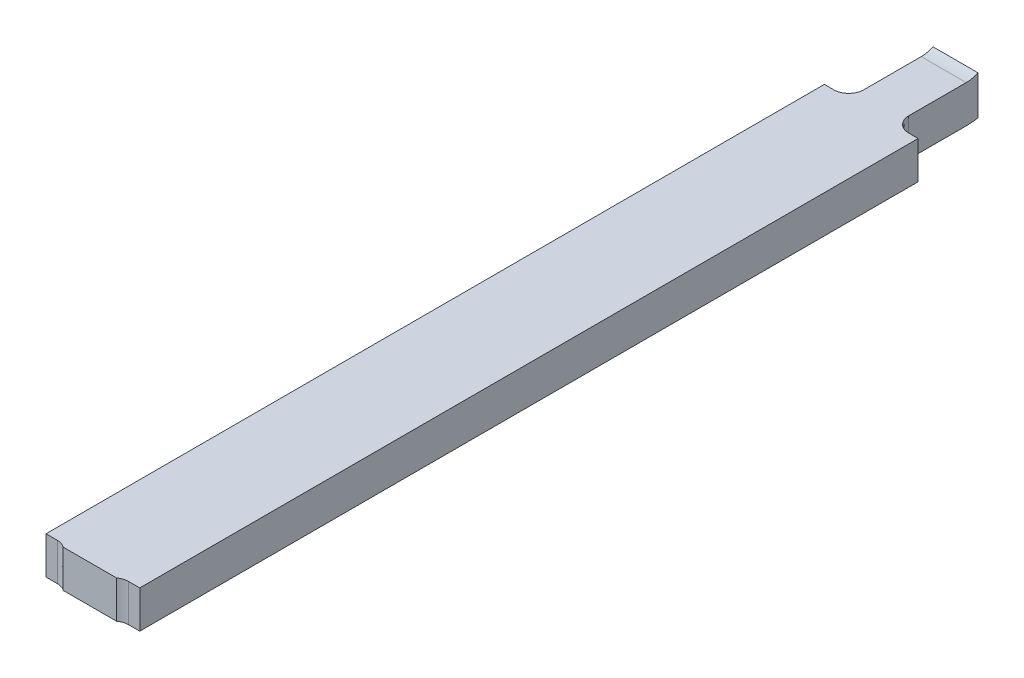
ISO-10303-21;
HEADER;
FILE_DESCRIPTION(('STEP AP214'),'2;1');
FILE_NAME('part.step','',(''),(''),'','','');
FILE_SCHEMA(('AUTOMOTIVE_DESIGN { 1 0 10303 214 1 1 1 1 }'));
ENDSEC;
DATA;
#1=APPLICATION_CONTEXT('core data for automotive mechanical design processes');
#2=APPLICATION_PROTOCOL_DEFINITION('international standard','automotive_design',2000,#1);
#3=PRODUCT_CONTEXT('',#1,'mechanical');
#4=PRODUCT('Part','Part','',(#3));
#5=PRODUCT_RELATED_PRODUCT_CATEGORY('part','',(#4));
#6=PRODUCT_DEFINITION_FORMATION('','',#4);
#7=PRODUCT_DEFINITION_CONTEXT('part definition',#1,'design');
#8=PRODUCT_DEFINITION('design','',#6,#7);
#9=PRODUCT_DEFINITION_SHAPE('','',#8);
#10=(LENGTH_UNIT() NAMED_UNIT(*) SI_UNIT(.MILLI.,.METRE.));
#11=(NAMED_UNIT(*) PLANE_ANGLE_UNIT() SI_UNIT($,.RADIAN.));
#12=(NAMED_UNIT(*) SI_UNIT($,.STERADIAN.) SOLID_ANGLE_UNIT());
#13=UNCERTAINTY_MEASURE_WITH_UNIT(LENGTH_MEASURE(1.E-05),#10,'distance_accuracy_value','');
#14=(GEOMETRIC_REPRESENTATION_CONTEXT(3) GLOBAL_UNCERTAINTY_ASSIGNED_CONTEXT((#13)) GLOBAL_UNIT_ASSIGNED_CONTEXT((#10,
#11,#12)) REPRESENTATION_CONTEXT('',''));
#15=CARTESIAN_POINT('',(0.,0.,0.));
#16=DIRECTION('',(0.,0.,1.));
#17=DIRECTION('',(1.,0.,0.));
#18=AXIS2_PLACEMENT_3D('',#15,#16,#17);
#19=CARTESIAN_POINT('',(1.,-0.3652289464185,-7.500488855463));
#20=DIRECTION('',(0.,0.,1.));
#21=DIRECTION('',(1.,0.,0.));
#22=AXIS2_PLACEMENT_3D('',#19,#20,#21);
#23=PLANE('',#22);
#24=DIRECTION('',(0.,1.,0.));
#25=VECTOR('',#24,1.);
#26=CARTESIAN_POINT('',(1.12,-0.3694122088881,-7.500488855463));
#27=LINE('',#26,#25);
#28=CARTESIAN_POINT('',(1.12,-0.469296338681694,-7.50048885546298));
#29=VERTEX_POINT('',#28);
#30=CARTESIAN_POINT('',(1.12,-0.261161554155171,-7.50048885546301));
#31=VERTEX_POINT('',#30);
#32=EDGE_CURVE('E150',#29,#31,#27,.T.);
#33=ORIENTED_EDGE('',*,*,#32,.F.);
#34=DIRECTION('',(-1.,0.,0.));
#35=VECTOR('',#34,1.);
#36=CARTESIAN_POINT('',(1.125727283719,-0.469296338681697,-7.50048885546296));
#37=LINE('',#36,#35);
#38=CARTESIAN_POINT('',(0.88,-0.469296338681694,-7.50048885546298));
#39=VERTEX_POINT('',#38);
#40=EDGE_CURVE('E139',#39,#29,#37,.F.);
#41=ORIENTED_EDGE('',*,*,#40,.F.);
#42=DIRECTION('',(0.,1.,0.));
#43=VECTOR('',#42,1.);
#44=CARTESIAN_POINT('',(0.88,-0.3694122088881,-7.500488855463));
#45=LINE('',#44,#43);
#46=CARTESIAN_POINT('',(0.88,-0.261161554155171,-7.50048885546301));
#47=VERTEX_POINT('',#46);
#48=EDGE_CURVE('E535',#39,#47,#45,.T.);
#49=ORIENTED_EDGE('',*,*,#48,.T.);
#50=DIRECTION('',(1.,0.,0.));
#51=VECTOR('',#50,1.);
#52=CARTESIAN_POINT('',(0.874272716281,-0.261161554155164,-7.50048885546303));
#53=LINE('',#52,#51);
#54=EDGE_CURVE('E147',#47,#31,#53,.T.);
#55=ORIENTED_EDGE('',*,*,#54,.T.);
#56=EDGE_LOOP('',(#33,#41,#49,#55));
#57=FACE_BOUND('',#56,.T.);
#58=ADVANCED_FACE('F17',(#57),#23,.F.);
#59=CARTESIAN_POINT('',(1.125727283719,-0.125,-7.43756007691));
#60=DIRECTION('',(-1.,0.,0.));
#61=DIRECTION('',(0.,0.,1.));
#62=AXIS2_PLACEMENT_3D('',#59,#60,#61);
#63=CYLINDRICAL_SURFACE('',#62,0.3499999999997);
#64=CARTESIAN_POINT('',(0.88,-0.125,-7.43756007691));
#65=DIRECTION('',(-1.,0.,0.));
#66=DIRECTION('',(0.,0.,1.));
#67=AXIS2_PLACEMENT_3D('',#64,#65,#66);
#68=CIRCLE('',#67,0.3499999999997);
#69=CARTESIAN_POINT('',(0.88,-0.475,-7.43756007691));
#70=VERTEX_POINT('',#69);
#71=EDGE_CURVE('E250',#70,#39,#68,.F.);
#72=ORIENTED_EDGE('',*,*,#71,.T.);
#73=ORIENTED_EDGE('',*,*,#40,.T.);
#74=CARTESIAN_POINT('',(1.12,-0.125,-7.43756007691));
#75=DIRECTION('',(-1.,0.,0.));
#76=DIRECTION('',(0.,0.,1.));
#77=AXIS2_PLACEMENT_3D('',#74,#75,#76);
#78=CIRCLE('',#77,0.3499999999997);
#79=CARTESIAN_POINT('',(1.12,-0.475,-7.43756007691));
#80=VERTEX_POINT('',#79);
#81=EDGE_CURVE('E274',#80,#29,#78,.F.);
#82=ORIENTED_EDGE('',*,*,#81,.F.);
#83=DIRECTION('',(1.,0.,0.));
#84=VECTOR('',#83,1.);
#85=CARTESIAN_POINT('',(1.,-0.475,-7.43756007691));
#86=LINE('',#85,#84);
#87=EDGE_CURVE('E138',#80,#70,#86,.F.);
#88=ORIENTED_EDGE('',*,*,#87,.T.);
#89=EDGE_LOOP('',(#72,#73,#82,#88));
#90=FACE_BOUND('',#89,.T.);
#91=ADVANCED_FACE('F255',(#90),#63,.T.);
#92=CARTESIAN_POINT('',(1.,-0.475,-5.160844573418));
#93=DIRECTION('',(0.,1.,0.));
#94=DIRECTION('',(0.,0.,1.));
#95=AXIS2_PLACEMENT_3D('',#92,#93,#94);
#96=PLANE('',#95);
#97=DIRECTION('',(1.,0.,0.));
#98=VECTOR('',#97,1.);
#99=CARTESIAN_POINT('',(1.,-0.475,-2.9));
#100=LINE('',#99,#98);
#101=CARTESIAN_POINT('',(0.75,-0.475,-2.9));
#102=VERTEX_POINT('',#101);
#103=CARTESIAN_POINT('',(0.809999999999999,-0.475,-2.89999999999976));
#104=VERTEX_POINT('',#103);
#105=EDGE_CURVE('E118',#102,#104,#100,.T.);
#106=ORIENTED_EDGE('',*,*,#105,.F.);
#107=DIRECTION('',(0.,0.,-1.));
#108=VECTOR('',#107,1.);
#109=CARTESIAN_POINT('',(0.75,-0.475,-4.975579331992));
#110=LINE('',#109,#108);
#111=CARTESIAN_POINT('',(0.75,-0.475,-7.051158663985));
#112=VERTEX_POINT('',#111);
#113=EDGE_CURVE('E213',#102,#112,#110,.T.);
#114=ORIENTED_EDGE('',*,*,#113,.T.);
#115=DIRECTION('',(1.,0.,0.));
#116=VECTOR('',#115,1.);
#117=CARTESIAN_POINT('',(0.775,-0.475,-7.051158663985));
#118=LINE('',#117,#116);
#119=CARTESIAN_POINT('',(0.8,-0.475,-7.05115866398505));
#120=VERTEX_POINT('',#119);
#121=EDGE_CURVE('E218',#112,#120,#118,.T.);
#122=ORIENTED_EDGE('',*,*,#121,.T.);
#123=CARTESIAN_POINT('',(0.880000000000138,-0.475,-7.131158663985));
#124=CARTESIAN_POINT('',(0.879991124404929,-0.475,-7.12663228539935));
#125=CARTESIAN_POINT('',(0.879604969526634,-0.475,-7.12211245444005));
#126=CARTESIAN_POINT('',(0.878084373258309,-0.475,-7.11320506981175));
#127=CARTESIAN_POINT('',(0.876950606898612,-0.475,-7.10881740054549));
#128=CARTESIAN_POINT('',(0.87244381446502,-0.475,-7.09604021502302));
#129=CARTESIAN_POINT('',(0.867965181347954,-0.475,-7.08801257628802));
#130=CARTESIAN_POINT('',(0.856658811354592,-0.475,-7.07397145931022));
#131=CARTESIAN_POINT('',(0.849850925128377,-0.475,-7.06794178198231));
#132=CARTESIAN_POINT('',(0.834570184316262,-0.475,-7.05845747919253));
#133=CARTESIAN_POINT('',(0.826089083751224,-0.475,-7.05501603051785));
#134=CARTESIAN_POINT('',(0.811615491326826,-0.475,-7.05178938735775));
#135=CARTESIAN_POINT('',(0.805803399607193,-0.475,-7.05114165155808));
#136=CARTESIAN_POINT('',(0.800000000000001,-0.475,-7.05115866398511));
#137=B_SPLINE_CURVE_WITH_KNOTS('',3,(#123,#124,#125,#126,#127,#128,#129,#130,#131,#132,#133,
#134,#135,#136),.UNSPECIFIED.,.F.,.F.,(4,2,2,2,2,2,4),(0.,0.0135512792193665,0.0270903394960009,
0.0541002294506573,0.0808854407505866,0.107806110467627,0.125207976056657),.UNSPECIFIED.);
#138=CARTESIAN_POINT('',(0.880000000000069,-0.475,-7.131158663985));
#139=VERTEX_POINT('',#138);
#140=EDGE_CURVE('E239',#139,#120,#137,.T.);
#141=ORIENTED_EDGE('',*,*,#140,.F.);
#142=DIRECTION('',(0.,0.,-1.));
#143=VECTOR('',#142,1.);
#144=CARTESIAN_POINT('',(0.88,-0.475,-7.317732357319));
#145=LINE('',#144,#143);
#146=EDGE_CURVE('E537',#139,#70,#145,.T.);
#147=ORIENTED_EDGE('',*,*,#146,.T.);
#148=ORIENTED_EDGE('',*,*,#87,.F.);
#149=DIRECTION('',(0.,0.,-1.));
#150=VECTOR('',#149,1.);
#151=CARTESIAN_POINT('',(1.12,-0.475,-7.317732357319));
#152=LINE('',#151,#150);
#153=CARTESIAN_POINT('',(1.12000000000005,-0.475,-7.131158663985));
#154=VERTEX_POINT('',#153);
#155=EDGE_CURVE('E533',#154,#80,#152,.T.);
#156=ORIENTED_EDGE('',*,*,#155,.F.);
#157=CARTESIAN_POINT('',(1.2,-0.475,-7.05115866398468));
#158=CARTESIAN_POINT('',(1.19547362141465,-0.475,-7.05116753957987));
#159=CARTESIAN_POINT('',(1.19095379045565,-0.475,-7.05155369445814));
#160=CARTESIAN_POINT('',(1.18204640582797,-0.475,-7.05307429072634));
#161=CARTESIAN_POINT('',(1.177658736562,-0.475,-7.05420805708594));
#162=CARTESIAN_POINT('',(1.16488155104036,-0.475,-7.05871484951899));
#163=CARTESIAN_POINT('',(1.15685391230581,-0.475,-7.06319348263538));
#164=CARTESIAN_POINT('',(1.14281279532797,-0.475,-7.07449985262762));
#165=CARTESIAN_POINT('',(1.13678311799971,-0.475,-7.08130773885357));
#166=CARTESIAN_POINT('',(1.12729881520918,-0.475,-7.09658847966527));
#167=CARTESIAN_POINT('',(1.1238573665341,-0.475,-7.10506958023014));
#168=CARTESIAN_POINT('',(1.12063072337303,-0.475,-7.11954317265563));
#169=CARTESIAN_POINT('',(1.11998298757307,-0.475,-7.12535526437654));
#170=CARTESIAN_POINT('',(1.12000000000011,-0.475,-7.131158663985));
#171=B_SPLINE_CURVE_WITH_KNOTS('',3,(#157,#158,#159,#160,#161,#162,#163,#164,#165,#166,#167,
#168,#169,#170),.UNSPECIFIED.,.F.,.F.,(4,2,2,2,2,2,4),(0.,0.013551279218447,0.0270903394941784,
0.0541002294468232,0.080885440746835,0.10780611046389,0.125207976056708),.UNSPECIFIED.);
#172=CARTESIAN_POINT('',(1.2,-0.475,-7.05115866398484));
#173=VERTEX_POINT('',#172);
#174=EDGE_CURVE('E266',#173,#154,#171,.T.);
#175=ORIENTED_EDGE('',*,*,#174,.F.);
#176=DIRECTION('',(1.,0.,0.));
#177=VECTOR('',#176,1.);
#178=CARTESIAN_POINT('',(1.225,-0.475,-7.051158663985));
#179=LINE('',#178,#177);
#180=CARTESIAN_POINT('',(1.25,-0.475,-7.051158663985));
#181=VERTEX_POINT('',#180);
#182=EDGE_CURVE('E151',#173,#181,#179,.T.);
#183=ORIENTED_EDGE('',*,*,#182,.T.);
#184=DIRECTION('',(0.,0.,-1.));
#185=VECTOR('',#184,1.);
#186=CARTESIAN_POINT('',(1.25,-0.475,-4.975579331992));
#187=LINE('',#186,#185);
#188=CARTESIAN_POINT('',(1.25,-0.475,-2.9));
#189=VERTEX_POINT('',#188);
#190=EDGE_CURVE('E155',#189,#181,#187,.T.);
#191=ORIENTED_EDGE('',*,*,#190,.F.);
#192=DIRECTION('',(1.,0.,0.));
#193=VECTOR('',#192,1.);
#194=CARTESIAN_POINT('',(1.22,-0.475,-2.9));
#195=LINE('',#194,#193);
#196=CARTESIAN_POINT('',(1.19,-0.475,-2.89999999999989));
#197=VERTEX_POINT('',#196);
#198=EDGE_CURVE('E163',#197,#189,#195,.T.);
#199=ORIENTED_EDGE('',*,*,#198,.F.);
#200=CARTESIAN_POINT('',(1.14217544757885,-0.475,-2.8841290699251));
#201=CARTESIAN_POINT('',(1.14622022070471,-0.475,-2.88715347788678));
#202=CARTESIAN_POINT('',(1.1505544258207,-0.475,-2.88978498732686));
#203=CARTESIAN_POINT('',(1.15913369497632,-0.475,-2.8939430866676));
#204=CARTESIAN_POINT('',(1.163335184109,-0.475,-2.89555994023161));
#205=CARTESIAN_POINT('',(1.17194880942201,-0.475,-2.89806057790455));
#206=CARTESIAN_POINT('',(1.17636081104946,-0.475,-2.898944823807));
#207=CARTESIAN_POINT('',(1.1838636348312,-0.475,-2.89981357444961));
#208=CARTESIAN_POINT('',(1.18693284156799,-0.475,-2.89999375978714));
#209=CARTESIAN_POINT('',(1.19,-0.475,-2.89999999999978));
#210=B_SPLINE_CURVE_WITH_KNOTS('',3,(#200,#201,#202,#203,#204,#205,#206,#207,#208,#209),
.UNSPECIFIED.,.F.,.F.,(4,2,2,2,4),(0.,0.0151223248428417,0.0285648972663195,0.0419989898086989,
0.0512012871013957),.UNSPECIFIED.);
#211=CARTESIAN_POINT('',(1.14217544757892,-0.475,-2.88412906992505));
#212=VERTEX_POINT('',#211);
#213=EDGE_CURVE('E125',#212,#197,#210,.T.);
#214=ORIENTED_EDGE('',*,*,#213,.F.);
#215=DIRECTION('',(1.,0.,0.));
#216=VECTOR('',#215,1.);
#217=CARTESIAN_POINT('',(1.,-0.475,-2.884129069925));
#218=LINE('',#217,#216);
#219=CARTESIAN_POINT('',(0.857824566372062,-0.475,-2.88412906992503));
#220=VERTEX_POINT('',#219);
#221=EDGE_CURVE('E129',#220,#212,#218,.T.);
#222=ORIENTED_EDGE('',*,*,#221,.F.);
#223=CARTESIAN_POINT('',(0.809999999999999,-0.475,-2.89999999999952));
#224=CARTESIAN_POINT('',(0.815032696381663,-0.475,-2.90001482409388));
#225=CARTESIAN_POINT('',(0.820081842166942,-0.475,-2.8995255759674));
#226=CARTESIAN_POINT('',(0.833852283950752,-0.475,-2.89686256447201));
#227=CARTESIAN_POINT('',(0.842399476080599,-0.475,-2.89367998586967));
#228=CARTESIAN_POINT('',(0.852807865700747,-0.475,-2.88765952253259));
#229=CARTESIAN_POINT('',(0.855374401283624,-0.475,-2.88596721904199));
#230=CARTESIAN_POINT('',(0.857824566372124,-0.475,-2.88412906992507));
#231=B_SPLINE_CURVE_WITH_KNOTS('',3,(#223,#224,#225,#226,#227,#228,#229,#230),.UNSPECIFIED.,.F.,
.F.,(4,2,2,4),(0.,0.0151178951010553,0.0419060489790438,0.0511063402020572),.UNSPECIFIED.);
#232=EDGE_CURVE('E20',#104,#220,#231,.T.);
#233=ORIENTED_EDGE('',*,*,#232,.F.);
#234=EDGE_LOOP('',(#106,#114,#122,#141,#147,#148,#156,#175,#183,#191,#199,#214,#222,#233));
#235=FACE_BOUND('',#234,.T.);
#236=ADVANCED_FACE('F135',(#235),#96,.F.);
#237=CARTESIAN_POINT('',(1.192867608479,-0.269272716281,-2.899957930186));
#238=CARTESIAN_POINT('',(1.191912675517,-0.269272716281,-2.899988554812));
#239=CARTESIAN_POINT('',(1.185731487658,-0.269272716281,-2.900079343105));
#240=CARTESIAN_POINT('',(1.174291413689,-0.269272716281,-2.898963559635));
#241=CARTESIAN_POINT('',(1.159190917084,-0.269272716281,-2.894390814224));
#242=CARTESIAN_POINT('',(1.1486873263,-0.269272716281,-2.888776760997));
#243=CARTESIAN_POINT('',(1.141721023167,-0.269272716281,-2.883851645707));
#244=CARTESIAN_POINT('',(1.139152051861,-0.269272716281,-2.881786274905));
#245=CARTESIAN_POINT('',(1.137705478113,-0.269272716281,-2.880535760884));
#246=(BOUNDED_CURVE() B_SPLINE_CURVE(3,(#237,#238,#239,#240,#241,#242,#243,#244,#245),
.UNSPECIFIED.,.F.,.F.) B_SPLINE_CURVE_WITH_KNOTS((4,1,1,1,1,1,4),(0.,0.0480076126077,
0.3103664664067,0.5726487803877,0.8349383013298,0.9041878403074,1.),
.UNSPECIFIED.) CURVE() GEOMETRIC_REPRESENTATION_ITEM() RATIONAL_B_SPLINE_CURVE((1.,1.,1.,1.,1.,
1.,1.,1.,1.)) REPRESENTATION_ITEM(''));
#247=DIRECTION('',(0.,-1.,0.));
#248=VECTOR('',#247,1.);
#249=SURFACE_OF_LINEAR_EXTRUSION('',#246,#248);
#250=CARTESIAN_POINT('',(1.14217544464745,-0.275,-2.88412906773656));
#251=CARTESIAN_POINT('',(1.14622021763433,-0.275,-2.88715347588347));
#252=CARTESIAN_POINT('',(1.15055442262976,-0.275,-2.88978498552233));
#253=CARTESIAN_POINT('',(1.15913369159401,-0.275,-2.89394308525624));
#254=CARTESIAN_POINT('',(1.16333518065168,-0.275,-2.89555993901277));
#255=CARTESIAN_POINT('',(1.17194880584973,-0.275,-2.89806057708111));
#256=CARTESIAN_POINT('',(1.17636080743732,-0.275,-2.89894482318606));
#257=CARTESIAN_POINT('',(1.18386363239326,-0.275,-2.89981357430863));
#258=CARTESIAN_POINT('',(1.18693284034915,-0.275,-2.89999375978684));
#259=CARTESIAN_POINT('',(1.19,-0.275,-2.89999999999978));
#260=B_SPLINE_CURVE_WITH_KNOTS('',3,(#250,#251,#252,#253,#254,#255,#256,#257,#258,#259),
.UNSPECIFIED.,.F.,.F.,(4,2,2,2,4),(0.,0.0151223248426723,0.0285648972632415,0.0419989898096561,
0.0512012907536544),.UNSPECIFIED.);
#261=CARTESIAN_POINT('',(1.14217544611323,-0.275,-2.88412906883078));
#262=VERTEX_POINT('',#261);
#263=CARTESIAN_POINT('',(1.19,-0.275,-2.9));
#264=VERTEX_POINT('',#263);
#265=EDGE_CURVE('E132',#262,#264,#260,.T.);
#266=ORIENTED_EDGE('',*,*,#265,.F.);
#267=DIRECTION('',(0.,1.,0.));
#268=VECTOR('',#267,1.);
#269=CARTESIAN_POINT('',(1.142175447579,-0.375,-2.884129069925));
#270=LINE('',#269,#268);
#271=EDGE_CURVE('E133',#212,#262,#270,.T.);
#272=ORIENTED_EDGE('',*,*,#271,.F.);
#273=ORIENTED_EDGE('',*,*,#213,.T.);
#274=DIRECTION('',(0.,1.,0.));
#275=VECTOR('',#274,1.);
#276=CARTESIAN_POINT('',(1.19,-0.375,-2.9));
#277=LINE('',#276,#275);
#278=EDGE_CURVE('E166',#264,#197,#277,.F.);
#279=ORIENTED_EDGE('',*,*,#278,.F.);
#280=EDGE_LOOP('',(#266,#272,#273,#279));
#281=FACE_BOUND('',#280,.T.);
#282=ADVANCED_FACE('F254',(#281),#249,.T.);
#283=CARTESIAN_POINT('',(1.22,-0.375,-2.9));
#284=DIRECTION('',(0.,0.,1.));
#285=DIRECTION('',(1.,0.,0.));
#286=AXIS2_PLACEMENT_3D('',#283,#284,#285);
#287=PLANE('',#286);
#288=DIRECTION('',(0.,1.,0.));
#289=VECTOR('',#288,1.);
#290=CARTESIAN_POINT('',(1.25,-0.375,-2.9));
#291=LINE('',#290,#289);
#292=CARTESIAN_POINT('',(1.25,-0.275,-2.9));
#293=VERTEX_POINT('',#292);
#294=EDGE_CURVE('E160',#293,#189,#291,.F.);
#295=ORIENTED_EDGE('',*,*,#294,.F.);
#296=DIRECTION('',(1.,0.,0.));
#297=VECTOR('',#296,1.);
#298=CARTESIAN_POINT('',(1.,-0.275,-2.9));
#299=LINE('',#298,#297);
#300=EDGE_CURVE('E306',#264,#293,#299,.T.);
#301=ORIENTED_EDGE('',*,*,#300,.F.);
#302=ORIENTED_EDGE('',*,*,#278,.T.);
#303=ORIENTED_EDGE('',*,*,#198,.T.);
#304=EDGE_LOOP('',(#295,#301,#302,#303));
#305=FACE_BOUND('',#304,.T.);
#306=ADVANCED_FACE('F368',(#305),#287,.T.);
#307=CARTESIAN_POINT('',(1.25,-0.375,-4.975579331992));
#308=DIRECTION('',(1.,0.,0.));
#309=DIRECTION('',(0.,0.,-1.));
#310=AXIS2_PLACEMENT_3D('',#307,#308,#309);
#311=PLANE('',#310);
#312=DIRECTION('',(0.,1.,0.));
#313=VECTOR('',#312,1.);
#314=CARTESIAN_POINT('',(1.25,-0.375,-7.051158663985));
#315=LINE('',#314,#313);
#316=CARTESIAN_POINT('',(1.25,-0.275,-7.051158663985));
#317=VERTEX_POINT('',#316);
#318=EDGE_CURVE('E154',#181,#317,#315,.T.);
#319=ORIENTED_EDGE('',*,*,#318,.T.);
#320=DIRECTION('',(0.,0.,1.));
#321=VECTOR('',#320,1.);
#322=CARTESIAN_POINT('',(1.25,-0.275,-5.160844573418));
#323=LINE('',#322,#321);
#324=EDGE_CURVE('E302',#293,#317,#323,.F.);
#325=ORIENTED_EDGE('',*,*,#324,.F.);
#326=ORIENTED_EDGE('',*,*,#294,.T.);
#327=ORIENTED_EDGE('',*,*,#190,.T.);
#328=EDGE_LOOP('',(#319,#325,#326,#327));
#329=FACE_BOUND('',#328,.T.);
#330=ADVANCED_FACE('F373',(#329),#311,.T.);
#331=CARTESIAN_POINT('',(1.225,-0.375,-7.051158663985));
#332=DIRECTION('',(0.,0.,1.));
#333=DIRECTION('',(1.,0.,0.));
#334=AXIS2_PLACEMENT_3D('',#331,#332,#333);
#335=PLANE('',#334);
#336=ORIENTED_EDGE('',*,*,#182,.F.);
#337=DIRECTION('',(0.,-1.,0.));
#338=VECTOR('',#337,1.);
#339=CARTESIAN_POINT('',(1.2,-0.269272716281,-7.05115866398468));
#340=LINE('',#339,#338);
#341=CARTESIAN_POINT('',(1.2,-0.275,-7.05115866398476));
#342=VERTEX_POINT('',#341);
#343=EDGE_CURVE('E273',#342,#173,#340,.T.);
#344=ORIENTED_EDGE('',*,*,#343,.F.);
#345=DIRECTION('',(1.,0.,0.));
#346=VECTOR('',#345,1.);
#347=CARTESIAN_POINT('',(1.,-0.275,-7.051158663985));
#348=LINE('',#347,#346);
#349=EDGE_CURVE('E305',#317,#342,#348,.F.);
#350=ORIENTED_EDGE('',*,*,#349,.F.);
#351=ORIENTED_EDGE('',*,*,#318,.F.);
#352=EDGE_LOOP('',(#336,#344,#350,#351));
#353=FACE_BOUND('',#352,.T.);
#354=ADVANCED_FACE('F283',(#353),#335,.F.);
#355=CARTESIAN_POINT('',(1.120042070413,-0.269272716281,-7.134026291144));
#356=CARTESIAN_POINT('',(1.120011445371,-0.269272716281,-7.133071351971));
#357=CARTESIAN_POINT('',(1.119920656285,-0.269272716281,-7.126890157897));
#358=CARTESIAN_POINT('',(1.121036440365,-0.269272716281,-7.115450077674));
#359=CARTESIAN_POINT('',(1.125609185776,-0.269272716281,-7.100349581069));
#360=CARTESIAN_POINT('',(1.133048947975,-0.269272716281,-7.086430187272));
#361=CARTESIAN_POINT('',(1.143068695624,-0.269272716281,-7.074236320435));
#362=CARTESIAN_POINT('',(1.155262096496,-0.269272716281,-7.064213675467));
#363=CARTESIAN_POINT('',(1.169183798376,-0.269272716281,-7.056770327068));
#364=CARTESIAN_POINT('',(1.184287959508,-0.269272716281,-7.05219575577));
#365=CARTESIAN_POINT('',(1.195729514596,-0.269272716281,-7.051079350384));
#366=CARTESIAN_POINT('',(1.201910679261,-0.269272716281,-7.051170096432));
#367=CARTESIAN_POINT('',(1.202864618741,-0.269272716281,-7.0512006723));
#368=(BOUNDED_CURVE() B_SPLINE_CURVE(3,(#355,#356,#357,#358,#359,#360,#361,#362,#363,#364,#365,
#366,#367),.UNSPECIFIED.,.F.,.F.) B_SPLINE_CURVE_WITH_KNOTS((4,1,1,1,1,1,1,1,1,1,4),(0.,
0.02187366901521,0.1414112381412,0.260913933719,0.380419912977,0.4999590271853,0.6195124003892,
0.7390518477007,0.8585895788734,0.9781493142558,1.),
.UNSPECIFIED.) CURVE() GEOMETRIC_REPRESENTATION_ITEM() RATIONAL_B_SPLINE_CURVE((1.,1.,1.,1.,1.,
1.,1.,1.,1.,1.,1.,1.,1.)) REPRESENTATION_ITEM(''));
#369=DIRECTION('',(0.,-1.,0.));
#370=VECTOR('',#369,1.);
#371=SURFACE_OF_LINEAR_EXTRUSION('',#368,#370);
#372=DIRECTION('',(0.,1.,0.));
#373=VECTOR('',#372,1.);
#374=CARTESIAN_POINT('',(1.12,-0.3694122088881,-7.131158663985));
#375=LINE('',#374,#373);
#376=CARTESIAN_POINT('',(1.12,-0.275,-7.131158663985));
#377=VERTEX_POINT('',#376);
#378=EDGE_CURVE('E272',#377,#154,#375,.F.);
#379=ORIENTED_EDGE('',*,*,#378,.F.);
#380=CARTESIAN_POINT('',(1.2,-0.275,-7.05115866398468));
#381=CARTESIAN_POINT('',(1.19547362141465,-0.275,-7.05116753957987));
#382=CARTESIAN_POINT('',(1.19095379045565,-0.275,-7.05155369445814));
#383=CARTESIAN_POINT('',(1.18204640582797,-0.275,-7.05307429072634));
#384=CARTESIAN_POINT('',(1.177658736562,-0.275,-7.05420805708594));
#385=CARTESIAN_POINT('',(1.16488155104036,-0.275,-7.05871484951899));
#386=CARTESIAN_POINT('',(1.15685391230581,-0.275,-7.06319348263538));
#387=CARTESIAN_POINT('',(1.14281279532797,-0.275,-7.07449985262762));
#388=CARTESIAN_POINT('',(1.13678311799971,-0.275,-7.08130773885357));
#389=CARTESIAN_POINT('',(1.12729881520918,-0.275,-7.09658847966527));
#390=CARTESIAN_POINT('',(1.1238573665341,-0.275,-7.10506958023014));
#391=CARTESIAN_POINT('',(1.12063072337303,-0.275,-7.11954317265563));
#392=CARTESIAN_POINT('',(1.11998298757307,-0.275,-7.12535526437654));
#393=CARTESIAN_POINT('',(1.12000000000011,-0.275,-7.131158663985));
#394=B_SPLINE_CURVE_WITH_KNOTS('',3,(#380,#381,#382,#383,#384,#385,#386,#387,#388,#389,#390,
#391,#392,#393),.UNSPECIFIED.,.F.,.F.,(4,2,2,2,2,2,4),(0.,0.013551279218447,0.0270903394941784,
0.0541002294468232,0.080885440746835,0.10780611046389,0.125207976056708),.UNSPECIFIED.);
#395=EDGE_CURVE('E355',#342,#377,#394,.T.);
#396=ORIENTED_EDGE('',*,*,#395,.F.);
#397=ORIENTED_EDGE('',*,*,#343,.T.);
#398=ORIENTED_EDGE('',*,*,#174,.T.);
#399=EDGE_LOOP('',(#379,#396,#397,#398));
#400=FACE_BOUND('',#399,.T.);
#401=ADVANCED_FACE('F276',(#400),#371,.T.);
#402=CARTESIAN_POINT('',(1.12,-0.3694122088881,-7.317732357319));
#403=DIRECTION('',(1.,0.,0.));
#404=DIRECTION('',(0.,0.,-1.));
#405=AXIS2_PLACEMENT_3D('',#402,#403,#404);
#406=PLANE('',#405);
#407=ORIENTED_EDGE('',*,*,#81,.T.);
#408=ORIENTED_EDGE('',*,*,#32,.T.);
#409=CARTESIAN_POINT('',(1.12,-0.125,-7.437560076911));
#410=DIRECTION('',(1.,0.,0.));
#411=DIRECTION('',(0.,0.,-1.));
#412=AXIS2_PLACEMENT_3D('',#409,#410,#411);
#413=CIRCLE('',#412,0.15);
#414=CARTESIAN_POINT('',(1.12,-0.275,-7.437560076911));
#415=VERTEX_POINT('',#414);
#416=EDGE_CURVE('E149',#31,#415,#413,.F.);
#417=ORIENTED_EDGE('',*,*,#416,.T.);
#418=DIRECTION('',(0.,0.,1.));
#419=VECTOR('',#418,1.);
#420=CARTESIAN_POINT('',(1.12,-0.275,-5.160844573418));
#421=LINE('',#420,#419);
#422=EDGE_CURVE('E348',#377,#415,#421,.F.);
#423=ORIENTED_EDGE('',*,*,#422,.F.);
#424=ORIENTED_EDGE('',*,*,#378,.T.);
#425=ORIENTED_EDGE('',*,*,#155,.T.);
#426=EDGE_LOOP('',(#407,#408,#417,#423,#424,#425));
#427=FACE_BOUND('',#426,.T.);
#428=ADVANCED_FACE('F282',(#427),#406,.T.);
#429=CARTESIAN_POINT('',(0.874272716281,-0.125,-7.437560076911));
#430=DIRECTION('',(1.,0.,0.));
#431=DIRECTION('',(0.,0.,-1.));
#432=AXIS2_PLACEMENT_3D('',#429,#430,#431);
#433=CYLINDRICAL_SURFACE('',#432,0.15);
#434=DIRECTION('',(1.,0.,0.));
#435=VECTOR('',#434,1.);
#436=CARTESIAN_POINT('',(1.,-0.275,-7.437560076911));
#437=LINE('',#436,#435);
#438=CARTESIAN_POINT('',(0.88,-0.275,-7.437560076911));
#439=VERTEX_POINT('',#438);
#440=EDGE_CURVE('E346',#415,#439,#437,.F.);
#441=ORIENTED_EDGE('',*,*,#440,.F.);
#442=ORIENTED_EDGE('',*,*,#416,.F.);
#443=ORIENTED_EDGE('',*,*,#54,.F.);
#444=CARTESIAN_POINT('',(0.88,-0.125,-7.437560076911));
#445=DIRECTION('',(1.,0.,0.));
#446=DIRECTION('',(0.,0.,-1.));
#447=AXIS2_PLACEMENT_3D('',#444,#445,#446);
#448=CIRCLE('',#447,0.15);
#449=EDGE_CURVE('E536',#47,#439,#448,.F.);
#450=ORIENTED_EDGE('',*,*,#449,.T.);
#451=EDGE_LOOP('',(#441,#442,#443,#450));
#452=FACE_BOUND('',#451,.T.);
#453=ADVANCED_FACE('F443',(#452),#433,.F.);
#454=CARTESIAN_POINT('',(0.88,-0.3694122088881,-7.317732357319));
#455=DIRECTION('',(1.,0.,0.));
#456=DIRECTION('',(0.,0.,-1.));
#457=AXIS2_PLACEMENT_3D('',#454,#455,#456);
#458=PLANE('',#457);
#459=ORIENTED_EDGE('',*,*,#146,.F.);
#460=DIRECTION('',(0.,-1.,0.));
#461=VECTOR('',#460,1.);
#462=CARTESIAN_POINT('',(0.880000000000138,-0.269272716281,-7.131158663985));
#463=LINE('',#462,#461);
#464=CARTESIAN_POINT('',(0.880000000000103,-0.275,-7.131158663985));
#465=VERTEX_POINT('',#464);
#466=EDGE_CURVE('E223',#465,#139,#463,.T.);
#467=ORIENTED_EDGE('',*,*,#466,.F.);
#468=DIRECTION('',(0.,0.,1.));
#469=VECTOR('',#468,1.);
#470=CARTESIAN_POINT('',(0.88,-0.275,-5.160844573418));
#471=LINE('',#470,#469);
#472=EDGE_CURVE('E345',#439,#465,#471,.T.);
#473=ORIENTED_EDGE('',*,*,#472,.F.);
#474=ORIENTED_EDGE('',*,*,#449,.F.);
#475=ORIENTED_EDGE('',*,*,#48,.F.);
#476=ORIENTED_EDGE('',*,*,#71,.F.);
#477=EDGE_LOOP('',(#459,#467,#473,#474,#475,#476));
#478=FACE_BOUND('',#477,.T.);
#479=ADVANCED_FACE('F234',(#478),#458,.F.);
#480=CARTESIAN_POINT('',(0.7971323728411,-0.269272716281,-7.051200734398));
#481=CARTESIAN_POINT('',(0.7980873120139,-0.269272716281,-7.051170109356));
#482=CARTESIAN_POINT('',(0.8042685060882,-0.269272716281,-7.05107932027));
#483=CARTESIAN_POINT('',(0.815708586311,-0.269272716281,-7.05219510435));
#484=CARTESIAN_POINT('',(0.830809082916,-0.269272716281,-7.056767849761));
#485=CARTESIAN_POINT('',(0.844728476713,-0.269272716281,-7.06420761196));
#486=CARTESIAN_POINT('',(0.85692234355,-0.269272716281,-7.074227359609));
#487=CARTESIAN_POINT('',(0.866944988518,-0.269272716281,-7.086420760481));
#488=CARTESIAN_POINT('',(0.874388336917,-0.269272716281,-7.100342462361));
#489=CARTESIAN_POINT('',(0.878962908215,-0.269272716281,-7.115446623493));
#490=CARTESIAN_POINT('',(0.8800793136006,-0.269272716281,-7.126888178581));
#491=CARTESIAN_POINT('',(0.8799885675529,-0.269272716281,-7.133069343246));
#492=CARTESIAN_POINT('',(0.8799579916848,-0.269272716281,-7.134023282726));
#493=(BOUNDED_CURVE() B_SPLINE_CURVE(3,(#480,#481,#482,#483,#484,#485,#486,#487,#488,#489,#490,
#491,#492),.UNSPECIFIED.,.F.,.F.) B_SPLINE_CURVE_WITH_KNOTS((4,1,1,1,1,1,1,1,1,1,4),(0.,
0.02187366901338,0.1414112381396,0.2609139337177,0.3804199129761,0.4999590271847,0.619512400389,
0.7390518477008,0.8585895788739,0.9781493142566,1.),
.UNSPECIFIED.) CURVE() GEOMETRIC_REPRESENTATION_ITEM() RATIONAL_B_SPLINE_CURVE((1.,1.,1.,1.,1.,
1.,1.,1.,1.,1.,1.,1.,1.)) REPRESENTATION_ITEM(''));
#494=DIRECTION('',(0.,-1.,0.));
#495=VECTOR('',#494,1.);
#496=SURFACE_OF_LINEAR_EXTRUSION('',#493,#495);
#497=DIRECTION('',(0.,1.,0.));
#498=VECTOR('',#497,1.);
#499=CARTESIAN_POINT('',(0.8,-0.375,-7.051158663985));
#500=LINE('',#499,#498);
#501=CARTESIAN_POINT('',(0.8,-0.275,-7.051158663985));
#502=VERTEX_POINT('',#501);
#503=EDGE_CURVE('E216',#120,#502,#500,.T.);
#504=ORIENTED_EDGE('',*,*,#503,.T.);
#505=CARTESIAN_POINT('',(0.880000000000138,-0.275,-7.131158663985));
#506=CARTESIAN_POINT('',(0.879991124404929,-0.275,-7.12663228539935));
#507=CARTESIAN_POINT('',(0.879604969526634,-0.275,-7.12211245444005));
#508=CARTESIAN_POINT('',(0.878084373258309,-0.275,-7.11320506981175));
#509=CARTESIAN_POINT('',(0.876950606898612,-0.275,-7.10881740054549));
#510=CARTESIAN_POINT('',(0.87244381446502,-0.275,-7.09604021502302));
#511=CARTESIAN_POINT('',(0.867965181347954,-0.275,-7.08801257628802));
#512=CARTESIAN_POINT('',(0.856658811354592,-0.275,-7.07397145931022));
#513=CARTESIAN_POINT('',(0.849850925128377,-0.275,-7.06794178198231));
#514=CARTESIAN_POINT('',(0.834570184316262,-0.275,-7.05845747919253));
#515=CARTESIAN_POINT('',(0.826089083751224,-0.275,-7.05501603051785));
#516=CARTESIAN_POINT('',(0.811615491326826,-0.275,-7.05178938735775));
#517=CARTESIAN_POINT('',(0.805803399607193,-0.275,-7.05114165155808));
#518=CARTESIAN_POINT('',(0.800000000000001,-0.275,-7.05115866398511));
#519=B_SPLINE_CURVE_WITH_KNOTS('',3,(#505,#506,#507,#508,#509,#510,#511,#512,#513,#514,#515,
#516,#517,#518),.UNSPECIFIED.,.F.,.F.,(4,2,2,2,2,2,4),(0.,0.0135512792193665,0.0270903394960009,
0.0541002294506573,0.0808854407505866,0.107806110467627,0.125207976056657),.UNSPECIFIED.);
#520=EDGE_CURVE('E175',#465,#502,#519,.T.);
#521=ORIENTED_EDGE('',*,*,#520,.F.);
#522=ORIENTED_EDGE('',*,*,#466,.T.);
#523=ORIENTED_EDGE('',*,*,#140,.T.);
#524=EDGE_LOOP('',(#504,#521,#522,#523));
#525=FACE_BOUND('',#524,.T.);
#526=ADVANCED_FACE('F228',(#525),#496,.T.);
#527=CARTESIAN_POINT('',(0.775,-0.375,-7.051158663985));
#528=DIRECTION('',(0.,0.,1.));
#529=DIRECTION('',(1.,0.,0.));
#530=AXIS2_PLACEMENT_3D('',#527,#528,#529);
#531=PLANE('',#530);
#532=ORIENTED_EDGE('',*,*,#121,.F.);
#533=DIRECTION('',(0.,1.,0.));
#534=VECTOR('',#533,1.);
#535=CARTESIAN_POINT('',(0.75,-0.375,-7.051158663985));
#536=LINE('',#535,#534);
#537=CARTESIAN_POINT('',(0.75,-0.275,-7.051158663985));
#538=VERTEX_POINT('',#537);
#539=EDGE_CURVE('E202',#112,#538,#536,.T.);
#540=ORIENTED_EDGE('',*,*,#539,.T.);
#541=DIRECTION('',(1.,0.,0.));
#542=VECTOR('',#541,1.);
#543=CARTESIAN_POINT('',(1.,-0.275,-7.051158663985));
#544=LINE('',#543,#542);
#545=EDGE_CURVE('E208',#502,#538,#544,.F.);
#546=ORIENTED_EDGE('',*,*,#545,.F.);
#547=ORIENTED_EDGE('',*,*,#503,.F.);
#548=EDGE_LOOP('',(#532,#540,#546,#547));
#549=FACE_BOUND('',#548,.T.);
#550=ADVANCED_FACE('F233',(#549),#531,.F.);
#551=CARTESIAN_POINT('',(0.75,-0.375,-4.975579331992));
#552=DIRECTION('',(1.,0.,0.));
#553=DIRECTION('',(0.,0.,-1.));
#554=AXIS2_PLACEMENT_3D('',#551,#552,#553);
#555=PLANE('',#554);
#556=ORIENTED_EDGE('',*,*,#113,.F.);
#557=DIRECTION('',(0.,1.,0.));
#558=VECTOR('',#557,1.);
#559=CARTESIAN_POINT('',(0.75,-0.375,-2.9));
#560=LINE('',#559,#558);
#561=CARTESIAN_POINT('',(0.75,-0.275,-2.9));
#562=VERTEX_POINT('',#561);
#563=EDGE_CURVE('E200',#562,#102,#560,.F.);
#564=ORIENTED_EDGE('',*,*,#563,.F.);
#565=DIRECTION('',(0.,0.,1.));
#566=VECTOR('',#565,1.);
#567=CARTESIAN_POINT('',(0.75,-0.275,-5.160844573418));
#568=LINE('',#567,#566);
#569=EDGE_CURVE('E205',#538,#562,#568,.T.);
#570=ORIENTED_EDGE('',*,*,#569,.F.);
#571=ORIENTED_EDGE('',*,*,#539,.F.);
#572=EDGE_LOOP('',(#556,#564,#570,#571));
#573=FACE_BOUND('',#572,.T.);
#574=ADVANCED_FACE('F384',(#573),#555,.F.);
#575=CARTESIAN_POINT('',(0.78,-0.375,-2.9));
#576=DIRECTION('',(0.,0.,1.));
#577=DIRECTION('',(1.,0.,0.));
#578=AXIS2_PLACEMENT_3D('',#575,#576,#577);
#579=PLANE('',#578);
#580=DIRECTION('',(0.,-1.,0.));
#581=VECTOR('',#580,1.);
#582=CARTESIAN_POINT('',(0.809999999999998,-0.269272716281,-2.89999999999951));
#583=LINE('',#582,#581);
#584=CARTESIAN_POINT('',(0.809999999999998,-0.275,-2.89999999999964));
#585=VERTEX_POINT('',#584);
#586=EDGE_CURVE('E122',#585,#104,#583,.T.);
#587=ORIENTED_EDGE('',*,*,#586,.F.);
#588=DIRECTION('',(1.,0.,0.));
#589=VECTOR('',#588,1.);
#590=CARTESIAN_POINT('',(1.,-0.275,-2.9));
#591=LINE('',#590,#589);
#592=EDGE_CURVE('E174',#562,#585,#591,.T.);
#593=ORIENTED_EDGE('',*,*,#592,.F.);
#594=ORIENTED_EDGE('',*,*,#563,.T.);
#595=ORIENTED_EDGE('',*,*,#105,.T.);
#596=EDGE_LOOP('',(#587,#593,#594,#595));
#597=FACE_BOUND('',#596,.T.);
#598=ADVANCED_FACE('F188',(#597),#579,.T.);
#599=CARTESIAN_POINT('',(0.862294531817,-0.269272716281,-2.880535754176));
#600=CARTESIAN_POINT('',(0.8608479592145,-0.269272716281,-2.881786269205));
#601=CARTESIAN_POINT('',(0.8582820974233,-0.269272716281,-2.88384914542));
#602=CARTESIAN_POINT('',(0.8513182381286,-0.269272716281,-2.888773339751));
#603=CARTESIAN_POINT('',(0.840816201624,-0.269272716281,-2.894388336917));
#604=CARTESIAN_POINT('',(0.825712040492,-0.269272716281,-2.898962908215));
#605=CARTESIAN_POINT('',(0.814270490801,-0.269272716281,-2.900079313074));
#606=CARTESIAN_POINT('',(0.8080893315006,-0.269272716281,-2.89998856771));
#607=CARTESIAN_POINT('',(0.8071353973821,-0.269272716281,-2.899957992201));
#608=(BOUNDED_CURVE() B_SPLINE_CURVE(3,(#599,#600,#601,#602,#603,#604,#605,#606,#607),
.UNSPECIFIED.,.F.,.F.) B_SPLINE_CURVE_WITH_KNOTS((4,1,1,1,1,1,4),(0.,0.09581704921318,
0.1648704820821,0.4272468470592,0.689619445294,0.9520403404257,1.),
.UNSPECIFIED.) CURVE() GEOMETRIC_REPRESENTATION_ITEM() RATIONAL_B_SPLINE_CURVE((1.,1.,1.,1.,1.,
1.,1.,1.,1.)) REPRESENTATION_ITEM(''));
#609=DIRECTION('',(0.,-1.,0.));
#610=VECTOR('',#609,1.);
#611=SURFACE_OF_LINEAR_EXTRUSION('',#608,#610);
#612=ORIENTED_EDGE('',*,*,#232,.T.);
#613=DIRECTION('',(0.,1.,0.));
#614=VECTOR('',#613,1.);
#615=CARTESIAN_POINT('',(0.857824566372,-0.375,-2.884129069925));
#616=LINE('',#615,#614);
#617=CARTESIAN_POINT('',(0.857824566372,-0.275,-2.884129069925));
#618=VERTEX_POINT('',#617);
#619=EDGE_CURVE('E40',#618,#220,#616,.F.);
#620=ORIENTED_EDGE('',*,*,#619,.F.);
#621=CARTESIAN_POINT('',(0.809999999999999,-0.275,-2.89999999999952));
#622=CARTESIAN_POINT('',(0.8150326963842,-0.275,-2.90001482409397));
#623=CARTESIAN_POINT('',(0.820081842168564,-0.275,-2.89952557596746));
#624=CARTESIAN_POINT('',(0.833852283947879,-0.275,-2.89686256447191));
#625=CARTESIAN_POINT('',(0.842399476072633,-0.275,-2.89367998586939));
#626=CARTESIAN_POINT('',(0.852807866753223,-0.275,-2.88765952192549));
#627=CARTESIAN_POINT('',(0.855374403315692,-0.275,-2.88596721770697));
#628=CARTESIAN_POINT('',(0.857824569285427,-0.275,-2.88412906775002));
#629=B_SPLINE_CURVE_WITH_KNOTS('',3,(#621,#622,#623,#624,#625,#626,#627,#628),.UNSPECIFIED.,.F.,
.F.,(4,2,2,4),(0.,0.0151178951010559,0.0419060489790436,0.0511063438316794),.UNSPECIFIED.);
#630=EDGE_CURVE('E31',#585,#618,#629,.T.);
#631=ORIENTED_EDGE('',*,*,#630,.F.);
#632=ORIENTED_EDGE('',*,*,#586,.T.);
#633=EDGE_LOOP('',(#612,#620,#631,#632));
#634=FACE_BOUND('',#633,.T.);
#635=ADVANCED_FACE('F121',(#634),#611,.T.);
#636=CARTESIAN_POINT('',(1.000000006975,-0.375,-2.884129069925));
#637=DIRECTION('',(0.,0.,1.));
#638=DIRECTION('',(1.,0.,0.));
#639=AXIS2_PLACEMENT_3D('',#636,#637,#638);
#640=PLANE('',#639);
#641=ORIENTED_EDGE('',*,*,#619,.T.);
#642=ORIENTED_EDGE('',*,*,#221,.T.);
#643=ORIENTED_EDGE('',*,*,#271,.T.);
#644=DIRECTION('',(1.,0.,0.));
#645=VECTOR('',#644,1.);
#646=CARTESIAN_POINT('',(1.,-0.275,-2.884129069925));
#647=LINE('',#646,#645);
#648=EDGE_CURVE('E11',#618,#262,#647,.T.);
#649=ORIENTED_EDGE('',*,*,#648,.F.);
#650=EDGE_LOOP('',(#641,#642,#643,#649));
#651=FACE_BOUND('',#650,.T.);
#652=ADVANCED_FACE('F127',(#651),#640,.T.);
#653=CARTESIAN_POINT('',(1.,-0.275,-5.160844573418));
#654=DIRECTION('',(0.,1.,0.));
#655=DIRECTION('',(0.,0.,1.));
#656=AXIS2_PLACEMENT_3D('',#653,#654,#655);
#657=PLANE('',#656);
#658=ORIENTED_EDGE('',*,*,#630,.T.);
#659=ORIENTED_EDGE('',*,*,#648,.T.);
#660=ORIENTED_EDGE('',*,*,#265,.T.);
#661=ORIENTED_EDGE('',*,*,#300,.T.);
#662=ORIENTED_EDGE('',*,*,#324,.T.);
#663=ORIENTED_EDGE('',*,*,#349,.T.);
#664=ORIENTED_EDGE('',*,*,#395,.T.);
#665=ORIENTED_EDGE('',*,*,#422,.T.);
#666=ORIENTED_EDGE('',*,*,#440,.T.);
#667=ORIENTED_EDGE('',*,*,#472,.T.);
#668=ORIENTED_EDGE('',*,*,#520,.T.);
#669=ORIENTED_EDGE('',*,*,#545,.T.);
#670=ORIENTED_EDGE('',*,*,#569,.T.);
#671=ORIENTED_EDGE('',*,*,#592,.T.);
#672=EDGE_LOOP('',(#658,#659,#660,#661,#662,#663,#664,#665,#666,#667,#668,#669,#670,#671));
#673=FACE_BOUND('',#672,.T.);
#674=ADVANCED_FACE('F181',(#673),#657,.T.);
#675=CLOSED_SHELL('',(#58,#91,#236,#282,#306,#330,#354,#401,#428,#453,#479,#526,#550,#574,#598,
#635,#652,#674));
#676=MANIFOLD_SOLID_BREP('B1',#675);
#677=ADVANCED_BREP_SHAPE_REPRESENTATION('',(#18,#676),#14);
#678=SHAPE_DEFINITION_REPRESENTATION(#9,#677);
ENDSEC;
END-ISO-10303-21;
